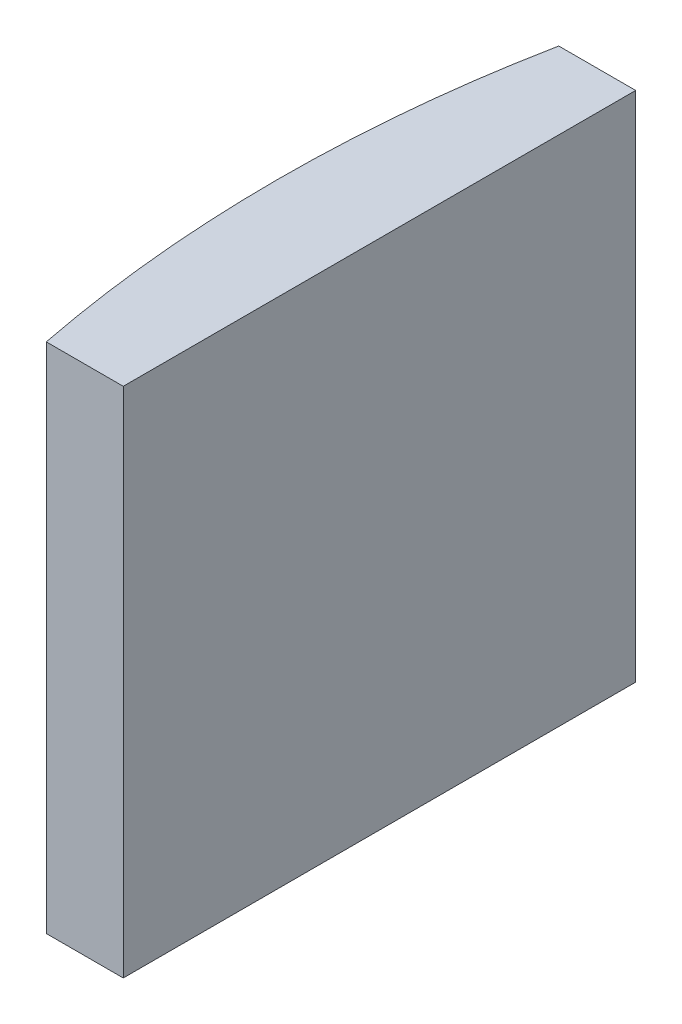
ISO-10303-21;
HEADER;
FILE_DESCRIPTION(('STEP AP214'),'2;1');
FILE_NAME('part.step','',(''),(''),'','','');
FILE_SCHEMA(('AUTOMOTIVE_DESIGN { 1 0 10303 214 1 1 1 1 }'));
ENDSEC;
DATA;
#1=APPLICATION_CONTEXT('core data for automotive mechanical design processes');
#2=APPLICATION_PROTOCOL_DEFINITION('international standard','automotive_design',2000,#1);
#3=PRODUCT_CONTEXT('',#1,'mechanical');
#4=PRODUCT('Part','Part','',(#3));
#5=PRODUCT_RELATED_PRODUCT_CATEGORY('part','',(#4));
#6=PRODUCT_DEFINITION_FORMATION('','',#4);
#7=PRODUCT_DEFINITION_CONTEXT('part definition',#1,'design');
#8=PRODUCT_DEFINITION('design','',#6,#7);
#9=PRODUCT_DEFINITION_SHAPE('','',#8);
#10=(LENGTH_UNIT() NAMED_UNIT(*) SI_UNIT(.MILLI.,.METRE.));
#11=(NAMED_UNIT(*) PLANE_ANGLE_UNIT() SI_UNIT($,.RADIAN.));
#12=(NAMED_UNIT(*) SI_UNIT($,.STERADIAN.) SOLID_ANGLE_UNIT());
#13=UNCERTAINTY_MEASURE_WITH_UNIT(LENGTH_MEASURE(1.E-05),#10,'distance_accuracy_value','');
#14=(GEOMETRIC_REPRESENTATION_CONTEXT(3) GLOBAL_UNCERTAINTY_ASSIGNED_CONTEXT((#13)) GLOBAL_UNIT_ASSIGNED_CONTEXT((#10,
#11,#12)) REPRESENTATION_CONTEXT('',''));
#15=CARTESIAN_POINT('',(0.,0.,0.));
#16=DIRECTION('',(0.,0.,1.));
#17=DIRECTION('',(1.,0.,0.));
#18=AXIS2_PLACEMENT_3D('',#15,#16,#17);
#19=CARTESIAN_POINT('',(4.35520433485127,20.,0.));
#20=DIRECTION('',(0.,-1.,0.));
#21=DIRECTION('',(0.,0.,-1.));
#22=AXIS2_PLACEMENT_3D('',#19,#20,#21);
#23=CYLINDRICAL_SURFACE('',#22,51.68);
#24=CARTESIAN_POINT('',(4.35520433485127,0.,0.));
#25=DIRECTION('',(0.,1.,0.));
#26=DIRECTION('',(0.,0.,1.));
#27=AXIS2_PLACEMENT_3D('',#24,#25,#26);
#28=CIRCLE('',#27,51.68);
#29=CARTESIAN_POINT('',(-46.3480736656883,0.,-10.));
#30=VERTEX_POINT('',#29);
#31=CARTESIAN_POINT('',(-46.3480736656883,0.,10.));
#32=VERTEX_POINT('',#31);
#33=EDGE_CURVE('E100',#30,#32,#28,.T.);
#34=ORIENTED_EDGE('',*,*,#33,.T.);
#35=DIRECTION('',(0.,-1.,0.));
#36=VECTOR('',#35,1.);
#37=CARTESIAN_POINT('',(-46.3480736656883,20.,10.));
#38=LINE('',#37,#36);
#39=CARTESIAN_POINT('',(-46.3480736656883,20.,10.));
#40=VERTEX_POINT('',#39);
#41=EDGE_CURVE('E11',#40,#32,#38,.T.);
#42=ORIENTED_EDGE('',*,*,#41,.F.);
#43=CARTESIAN_POINT('',(4.35520433485127,20.,0.));
#44=DIRECTION('',(0.,1.,0.));
#45=DIRECTION('',(0.,0.,1.));
#46=AXIS2_PLACEMENT_3D('',#43,#44,#45);
#47=CIRCLE('',#46,51.68);
#48=CARTESIAN_POINT('',(-46.3480736656883,20.,-10.));
#49=VERTEX_POINT('',#48);
#50=EDGE_CURVE('E88',#49,#40,#47,.T.);
#51=ORIENTED_EDGE('',*,*,#50,.F.);
#52=DIRECTION('',(0.,-1.,0.));
#53=VECTOR('',#52,1.);
#54=CARTESIAN_POINT('',(-46.3480736656883,20.,-10.));
#55=LINE('',#54,#53);
#56=EDGE_CURVE('E96',#49,#30,#55,.T.);
#57=ORIENTED_EDGE('',*,*,#56,.T.);
#58=EDGE_LOOP('',(#34,#42,#51,#57));
#59=FACE_BOUND('',#58,.T.);
#60=ADVANCED_FACE('F37',(#59),#23,.T.);
#61=CARTESIAN_POINT('',(-46.3480736656883,20.,10.));
#62=DIRECTION('',(0.,0.,-1.));
#63=DIRECTION('',(-1.,0.,0.));
#64=AXIS2_PLACEMENT_3D('',#61,#62,#63);
#65=PLANE('',#64);
#66=DIRECTION('',(1.,0.,0.));
#67=VECTOR('',#66,1.);
#68=CARTESIAN_POINT('',(-46.3480736656883,0.,10.));
#69=LINE('',#68,#67);
#70=CARTESIAN_POINT('',(-43.3447956651487,0.,10.));
#71=VERTEX_POINT('',#70);
#72=EDGE_CURVE('E92',#32,#71,#69,.T.);
#73=ORIENTED_EDGE('',*,*,#72,.T.);
#74=DIRECTION('',(0.,-1.,0.));
#75=VECTOR('',#74,1.);
#76=CARTESIAN_POINT('',(-43.3447956651487,20.,10.));
#77=LINE('',#76,#75);
#78=CARTESIAN_POINT('',(-43.3447956651487,20.,10.));
#79=VERTEX_POINT('',#78);
#80=EDGE_CURVE('E45',#79,#71,#77,.T.);
#81=ORIENTED_EDGE('',*,*,#80,.F.);
#82=DIRECTION('',(1.,0.,0.));
#83=VECTOR('',#82,1.);
#84=CARTESIAN_POINT('',(-46.3480736656883,20.,10.));
#85=LINE('',#84,#83);
#86=EDGE_CURVE('E83',#40,#79,#85,.T.);
#87=ORIENTED_EDGE('',*,*,#86,.F.);
#88=ORIENTED_EDGE('',*,*,#41,.T.);
#89=EDGE_LOOP('',(#73,#81,#87,#88));
#90=FACE_BOUND('',#89,.T.);
#91=ADVANCED_FACE('F91',(#90),#65,.F.);
#92=CARTESIAN_POINT('',(-43.3447956651487,20.,-9.99999999999999));
#93=DIRECTION('',(-1.,0.,0.));
#94=DIRECTION('',(0.,0.,1.));
#95=AXIS2_PLACEMENT_3D('',#92,#93,#94);
#96=PLANE('',#95);
#97=DIRECTION('',(0.,0.,-1.));
#98=VECTOR('',#97,1.);
#99=CARTESIAN_POINT('',(-43.3447956651487,0.,-9.99999999999999));
#100=LINE('',#99,#98);
#101=CARTESIAN_POINT('',(-43.3447956651487,0.,-9.99999999999999));
#102=VERTEX_POINT('',#101);
#103=EDGE_CURVE('E70',#71,#102,#100,.T.);
#104=ORIENTED_EDGE('',*,*,#103,.T.);
#105=DIRECTION('',(0.,-1.,0.));
#106=VECTOR('',#105,1.);
#107=CARTESIAN_POINT('',(-43.3447956651487,20.,-9.99999999999999));
#108=LINE('',#107,#106);
#109=CARTESIAN_POINT('',(-43.3447956651487,20.,-9.99999999999999));
#110=VERTEX_POINT('',#109);
#111=EDGE_CURVE('E93',#110,#102,#108,.T.);
#112=ORIENTED_EDGE('',*,*,#111,.F.);
#113=DIRECTION('',(0.,0.,-1.));
#114=VECTOR('',#113,1.);
#115=CARTESIAN_POINT('',(-43.3447956651487,20.,-9.99999999999999));
#116=LINE('',#115,#114);
#117=EDGE_CURVE('E86',#79,#110,#116,.T.);
#118=ORIENTED_EDGE('',*,*,#117,.F.);
#119=ORIENTED_EDGE('',*,*,#80,.T.);
#120=EDGE_LOOP('',(#104,#112,#118,#119));
#121=FACE_BOUND('',#120,.T.);
#122=ADVANCED_FACE('F94',(#121),#96,.F.);
#123=CARTESIAN_POINT('',(-46.3480736656883,20.,-10.));
#124=DIRECTION('',(0.,0.,1.));
#125=DIRECTION('',(1.,0.,0.));
#126=AXIS2_PLACEMENT_3D('',#123,#124,#125);
#127=PLANE('',#126);
#128=DIRECTION('',(-1.,0.,0.));
#129=VECTOR('',#128,1.);
#130=CARTESIAN_POINT('',(-46.3480736656883,0.,-10.));
#131=LINE('',#130,#129);
#132=EDGE_CURVE('E76',#102,#30,#131,.T.);
#133=ORIENTED_EDGE('',*,*,#132,.T.);
#134=ORIENTED_EDGE('',*,*,#56,.F.);
#135=DIRECTION('',(-1.,0.,0.));
#136=VECTOR('',#135,1.);
#137=CARTESIAN_POINT('',(-46.3480736656883,20.,-10.));
#138=LINE('',#137,#136);
#139=EDGE_CURVE('E53',#110,#49,#138,.T.);
#140=ORIENTED_EDGE('',*,*,#139,.F.);
#141=ORIENTED_EDGE('',*,*,#111,.T.);
#142=EDGE_LOOP('',(#133,#134,#140,#141));
#143=FACE_BOUND('',#142,.T.);
#144=ADVANCED_FACE('F107',(#143),#127,.F.);
#145=CARTESIAN_POINT('',(4.35520433485127,20.,0.));
#146=DIRECTION('',(0.,1.,0.));
#147=DIRECTION('',(0.,0.,1.));
#148=AXIS2_PLACEMENT_3D('',#145,#146,#147);
#149=PLANE('',#148);
#150=ORIENTED_EDGE('',*,*,#50,.T.);
#151=ORIENTED_EDGE('',*,*,#86,.T.);
#152=ORIENTED_EDGE('',*,*,#117,.T.);
#153=ORIENTED_EDGE('',*,*,#139,.T.);
#154=EDGE_LOOP('',(#150,#151,#152,#153));
#155=FACE_BOUND('',#154,.T.);
#156=ADVANCED_FACE('F84',(#155),#149,.T.);
#157=CARTESIAN_POINT('',(4.35520433485127,0.,0.));
#158=DIRECTION('',(0.,1.,0.));
#159=DIRECTION('',(0.,0.,1.));
#160=AXIS2_PLACEMENT_3D('',#157,#158,#159);
#161=PLANE('',#160);
#162=ORIENTED_EDGE('',*,*,#33,.F.);
#163=ORIENTED_EDGE('',*,*,#132,.F.);
#164=ORIENTED_EDGE('',*,*,#103,.F.);
#165=ORIENTED_EDGE('',*,*,#72,.F.);
#166=EDGE_LOOP('',(#162,#163,#164,#165));
#167=FACE_BOUND('',#166,.T.);
#168=ADVANCED_FACE('F110',(#167),#161,.F.);
#169=CLOSED_SHELL('',(#60,#91,#122,#144,#156,#168));
#170=MANIFOLD_SOLID_BREP('B2',#169);
#171=ADVANCED_BREP_SHAPE_REPRESENTATION('',(#18,#170),#14);
#172=SHAPE_DEFINITION_REPRESENTATION(#9,#171);
ENDSEC;
END-ISO-10303-21;
